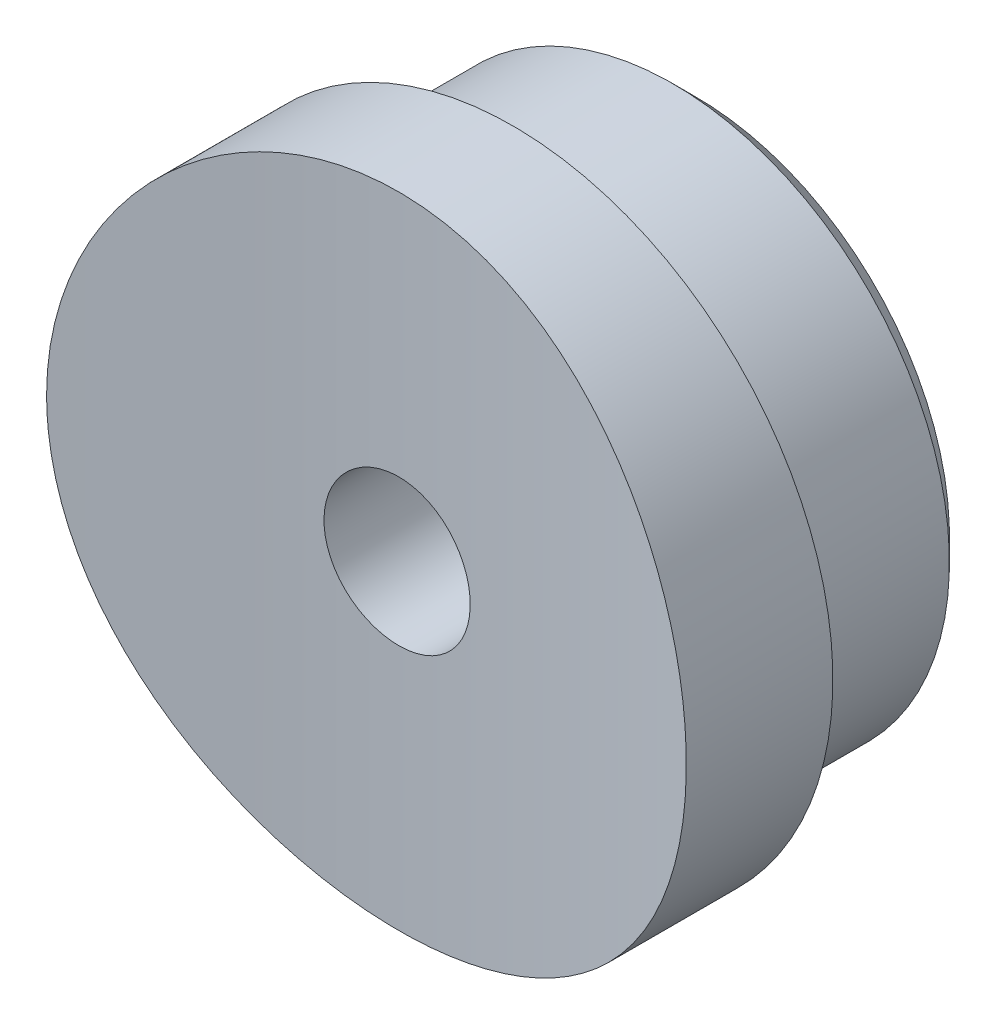
ISO-10303-21;
HEADER;
FILE_DESCRIPTION(('STEP AP214'),'2;1');
FILE_NAME('part.step','',(''),(''),'','','');
FILE_SCHEMA(('AUTOMOTIVE_DESIGN { 1 0 10303 214 1 1 1 1 }'));
ENDSEC;
DATA;
#1=APPLICATION_CONTEXT('core data for automotive mechanical design processes');
#2=APPLICATION_PROTOCOL_DEFINITION('international standard','automotive_design',2000,#1);
#3=PRODUCT_CONTEXT('',#1,'mechanical');
#4=PRODUCT('Part','Part','',(#3));
#5=PRODUCT_RELATED_PRODUCT_CATEGORY('part','',(#4));
#6=PRODUCT_DEFINITION_FORMATION('','',#4);
#7=PRODUCT_DEFINITION_CONTEXT('part definition',#1,'design');
#8=PRODUCT_DEFINITION('design','',#6,#7);
#9=PRODUCT_DEFINITION_SHAPE('','',#8);
#10=(LENGTH_UNIT() NAMED_UNIT(*) SI_UNIT(.MILLI.,.METRE.));
#11=(NAMED_UNIT(*) PLANE_ANGLE_UNIT() SI_UNIT($,.RADIAN.));
#12=(NAMED_UNIT(*) SI_UNIT($,.STERADIAN.) SOLID_ANGLE_UNIT());
#13=UNCERTAINTY_MEASURE_WITH_UNIT(LENGTH_MEASURE(1.E-05),#10,'distance_accuracy_value','');
#14=(GEOMETRIC_REPRESENTATION_CONTEXT(3) GLOBAL_UNCERTAINTY_ASSIGNED_CONTEXT((#13)) GLOBAL_UNIT_ASSIGNED_CONTEXT((#10,
#11,#12)) REPRESENTATION_CONTEXT('',''));
#15=CARTESIAN_POINT('',(0.,0.,0.));
#16=DIRECTION('',(0.,0.,1.));
#17=DIRECTION('',(1.,0.,0.));
#18=AXIS2_PLACEMENT_3D('',#15,#16,#17);
#19=CARTESIAN_POINT('',(7.,14.,-2.5));
#20=DIRECTION('',(0.,0.,1.));
#21=DIRECTION('',(1.,0.,0.));
#22=AXIS2_PLACEMENT_3D('',#19,#20,#21);
#23=PLANE('',#22);
#24=CARTESIAN_POINT('',(0.,7.,-2.5));
#25=DIRECTION('',(0.,0.,-1.));
#26=DIRECTION('',(-1.,0.,0.));
#27=AXIS2_PLACEMENT_3D('',#24,#25,#26);
#28=CIRCLE('',#27,6.05);
#29=CARTESIAN_POINT('',(-6.05,7.,-2.5));
#30=VERTEX_POINT('',#29);
#31=EDGE_CURVE('E66',#30,#30,#28,.T.);
#32=ORIENTED_EDGE('',*,*,#31,.F.);
#33=EDGE_LOOP('',(#32));
#34=FACE_BOUND('',#33,.T.);
#35=CARTESIAN_POINT('',(0.,7.,-2.5));
#36=DIRECTION('',(0.,0.,-1.));
#37=DIRECTION('',(-1.,0.,0.));
#38=AXIS2_PLACEMENT_3D('',#35,#36,#37);
#39=CIRCLE('',#38,7.);
#40=CARTESIAN_POINT('',(-7.,7.,-2.5));
#41=VERTEX_POINT('',#40);
#42=EDGE_CURVE('E83',#41,#41,#39,.T.);
#43=ORIENTED_EDGE('',*,*,#42,.T.);
#44=EDGE_LOOP('',(#43));
#45=FACE_BOUND('',#44,.T.);
#46=ADVANCED_FACE('F50',(#34,#45),#23,.F.);
#47=CARTESIAN_POINT('',(0.,14.,35.));
#48=DIRECTION('',(0.,-1.,0.));
#49=DIRECTION('',(0.,0.,-1.));
#50=AXIS2_PLACEMENT_3D('',#47,#48,#49);
#51=CYLINDRICAL_SURFACE('',#50,35.);
#52=CARTESIAN_POINT('',(-1.6,7.,0.0365905552676404));
#53=CARTESIAN_POINT('',(-1.59999603251046,7.08982230935875,0.0365900631684028));
#54=CARTESIAN_POINT('',(-1.59241080534589,7.17970855311235,0.0362407001403127));
#55=CARTESIAN_POINT('',(-1.56225902518611,7.35700206916885,0.0348807280095771));
#56=CARTESIAN_POINT('',(-1.53967475798923,7.44440628271039,0.0338693370575155));
#57=CARTESIAN_POINT('',(-1.48017226417196,7.61414176456258,0.0313001135826514));
#58=CARTESIAN_POINT('',(-1.44326126905072,7.69647556793792,0.0297425567784821));
#59=CARTESIAN_POINT('',(-1.35616400595942,7.85375606940907,0.0262568560726992));
#60=CARTESIAN_POINT('',(-1.30598089898924,7.92870452063732,0.0243288004421167));
#61=CARTESIAN_POINT('',(-1.193714969461,8.06917449702193,0.020317433367977));
#62=CARTESIAN_POINT('',(-1.13162316006113,8.13468883698272,0.0182340054038236));
#63=CARTESIAN_POINT('',(-0.997320037115527,8.25436973559786,0.0141477639445384));
#64=CARTESIAN_POINT('',(-0.925108313306346,8.30853583396988,0.0121449537219061));
#65=CARTESIAN_POINT('',(-0.772579135432526,8.40400123079447,0.00844480783740266));
#66=CARTESIAN_POINT('',(-0.692258291409238,8.44529511838057,0.00674760076285946));
#67=CARTESIAN_POINT('',(-0.525814796203896,8.51380913007604,0.00385107335846876));
#68=CARTESIAN_POINT('',(-0.439692183634218,8.54102934783912,0.0026517497154495));
#69=CARTESIAN_POINT('',(-0.264154268886323,8.5806048676508,0.000886909864028627));
#70=CARTESIAN_POINT('',(-0.174741333410031,8.59297064701238,0.000320946945240545));
#71=CARTESIAN_POINT('',(0.00489287983636078,8.60251859609575,-0.000114885948178931));
#72=CARTESIAN_POINT('',(0.0951141520444085,8.59970087021312,1.52392911711064E-05));
#73=CARTESIAN_POINT('',(0.273733044474519,8.57897051104271,0.00095654069370121));
#74=CARTESIAN_POINT('',(0.362131977073956,8.56106915927871,0.00176720785624695));
#75=CARTESIAN_POINT('',(0.534668745707059,8.51069718333591,0.00397768170900068));
#76=CARTESIAN_POINT('',(0.618806566037045,8.47822650546841,0.00537749057022369));
#77=CARTESIAN_POINT('',(0.78046908853887,8.39962471439854,0.00860942360492793));
#78=CARTESIAN_POINT('',(0.857991284318649,8.35348845319632,0.01044171064553));
#79=CARTESIAN_POINT('',(1.00419457839483,8.24886890364598,0.0143322174306972));
#80=CARTESIAN_POINT('',(1.07287562507272,8.19038554321532,0.0163904384942347));
#81=CARTESIAN_POINT('',(1.19951280224942,8.0626681272547,0.0205032063948754));
#82=CARTESIAN_POINT('',(1.25745906278686,7.99342428462489,0.0225577481474423));
#83=CARTESIAN_POINT('',(1.36090576706526,7.84618589630842,0.0264296385537858));
#84=CARTESIAN_POINT('',(1.40640620788382,7.76819134856701,0.028246987151867));
#85=CARTESIAN_POINT('',(1.48366876991119,7.60565967054864,0.031439411727319));
#86=CARTESIAN_POINT('',(1.51543053302928,7.52112236980628,0.0328144761765685));
#87=CARTESIAN_POINT('',(1.564307610156,7.34790753152688,0.0349668189863988));
#88=CARTESIAN_POINT('',(1.58142301626911,7.25923002002949,0.0357441011061653));
#89=CARTESIAN_POINT('',(1.60050935389465,7.08033793822746,0.0366125352846522));
#90=CARTESIAN_POINT('',(1.60249397826954,6.99012483171716,0.0367043077056994));
#91=CARTESIAN_POINT('',(1.59129813665862,6.81064684042022,0.036192992844107));
#92=CARTESIAN_POINT('',(1.57811771245672,6.72138195302165,0.0355899074759934));
#93=CARTESIAN_POINT('',(1.53697726974449,6.54637269653808,0.0337574196386319));
#94=CARTESIAN_POINT('',(1.50902350724693,6.46062685380662,0.0325282822893566));
#95=CARTESIAN_POINT('',(1.43913622493794,6.29504433373077,0.0295824572828065));
#96=CARTESIAN_POINT('',(1.39720263769836,6.21520768489014,0.0278657672739508));
#97=CARTESIAN_POINT('',(1.30051086272365,6.06364680300981,0.0241368213771836));
#98=CARTESIAN_POINT('',(1.24574347063267,5.99192844738645,0.0221243537467004));
#99=CARTESIAN_POINT('',(1.12495219467397,5.85869907151653,0.0180314349565567));
#100=CARTESIAN_POINT('',(1.05892824995501,5.79718810645315,0.0159509834294346));
#101=CARTESIAN_POINT('',(0.917439273522795,5.68607364405741,0.0119547832210798));
#102=CARTESIAN_POINT('',(0.841967295308717,5.63647898712045,0.01003915749189));
#103=CARTESIAN_POINT('',(0.683759801826339,5.55066537757432,0.00659026900767956));
#104=CARTESIAN_POINT('',(0.60102431428758,5.51444637390433,0.00505700479302213));
#105=CARTESIAN_POINT('',(0.430671358626741,5.45642767299037,0.00254623638509237));
#106=CARTESIAN_POINT('',(0.343055826121985,5.43462230227563,0.00156851354183241));
#107=CARTESIAN_POINT('',(0.165402696787812,5.40603125732229,0.000278154167754272));
#108=CARTESIAN_POINT('',(0.075365110664006,5.39924551670715,-3.44853022800989E-05));
#109=CARTESIAN_POINT('',(-0.104488444172776,5.40088701134011,4.05436056442141E-05));
#110=CARTESIAN_POINT('',(-0.194304540149235,5.4093003682873,0.000427573115852465));
#111=CARTESIAN_POINT('',(-0.371247753070772,5.44107257384797,0.00185710271096491));
#112=CARTESIAN_POINT('',(-0.458374864871483,5.46443145105226,0.00289960404978786));
#113=CARTESIAN_POINT('',(-0.627470134876942,5.52542891156803,0.00552275523222708));
#114=CARTESIAN_POINT('',(-0.709438239079783,5.56306764432492,0.00710341070786163));
#115=CARTESIAN_POINT('',(-0.865892148926715,5.65155371559135,0.0106250187551743));
#116=CARTESIAN_POINT('',(-0.940378194598089,5.70240063018962,0.012565959763063));
#117=CARTESIAN_POINT('',(-1.07982231622105,5.81590843378396,0.0165916134487838));
#118=CARTESIAN_POINT('',(-1.14477267857191,5.87857879438379,0.0186764405367522));
#119=CARTESIAN_POINT('',(-1.263250157843,6.01395210283898,0.0227542057000625));
#120=CARTESIAN_POINT('',(-1.31677445574384,6.08665751925803,0.0247471210042256));
#121=CARTESIAN_POINT('',(-1.41090141417986,6.24008686335503,0.0284174654941289));
#122=CARTESIAN_POINT('',(-1.45149267396095,6.32081778390503,0.0300946157963982));
#123=CARTESIAN_POINT('',(-1.51849657197888,6.48789555406184,0.0329397371298798));
#124=CARTESIAN_POINT('',(-1.54492599882545,6.57423561730652,0.0341083107598585));
#125=CARTESIAN_POINT('',(-1.57590509189012,6.71759537607352,0.0354943310481097));
#126=CARTESIAN_POINT('',(-1.58492918948196,6.77368598022787,0.0359036091059517));
#127=CARTESIAN_POINT('',(-1.59697789492852,6.8865092137755,0.0364518765972318));
#128=CARTESIAN_POINT('',(-1.6000025070319,6.94324184271409,0.0365908662220807));
#129=CARTESIAN_POINT('',(-1.6,7.,0.0365905552676404));
#130=B_SPLINE_CURVE_WITH_KNOTS('',3,(#52,#53,#54,#55,#56,#57,#58,#59,#60,#61,#62,#63,#64,#65,
#66,#67,#68,#69,#70,#71,#72,#73,#74,#75,#76,#77,#78,#79,#80,#81,#82,#83,#84,#85,#86,#87,#88,#89,
#90,#91,#92,#93,#94,#95,#96,#97,#98,#99,#100,#101,#102,#103,#104,#105,#106,#107,#108,#109,#110,
#111,#112,#113,#114,#115,#116,#117,#118,#119,#120,#121,#122,#123,#124,#125,#126,#127,#128,#129),
.UNSPECIFIED.,.T.,.F.,(4,2,2,2,2,2,2,2,2,2,2,2,2,2,2,2,2,2,2,2,2,2,2,2,2,2,2,2,2,2,2,2,2,2,2,2,
2,2,4),(0.,0.269259742710959,0.53883805404294,0.808280470738463,1.07765877241932,
1.34724116467661,1.61683448902378,1.88654098526754,2.15624568671717,2.42576004486211,
2.69527254993852,2.96458365678232,3.23389575605897,3.50330943795457,3.77272469273454,
4.04238644165521,4.31204825389508,4.58171709429145,4.85138423884728,5.12080731445916,
5.39022964773748,5.65953798101369,5.92884761324925,6.19835098768673,6.46785581906538,
6.73755997588626,7.0072631031157,7.27686000692234,7.54645571929155,7.81580538813915,
8.0851555722547,8.35450857532432,8.62385293468569,8.89341398549846,9.1630414652934,
9.43290597415438,9.70244985148553,9.87259352469369,10.0427370774108),.UNSPECIFIED.);
#131=CARTESIAN_POINT('',(-1.6,7.,0.0365905552676404));
#132=VERTEX_POINT('',#131);
#133=EDGE_CURVE('E103',#132,#132,#130,.T.);
#134=ORIENTED_EDGE('',*,*,#133,.T.);
#135=EDGE_LOOP('',(#134));
#136=FACE_BOUND('',#135,.T.);
#137=CARTESIAN_POINT('',(-7.,7.,0.707143601035506));
#138=CARTESIAN_POINT('',(-7.00000256201427,7.19450607109619,0.707144987961641));
#139=CARTESIAN_POINT('',(-6.99188990560942,7.38897681245728,0.705485368825013));
#140=CARTESIAN_POINT('',(-6.95950756673834,7.77657394297217,0.698898819525174));
#141=CARTESIAN_POINT('',(-6.93523432420624,7.96970002643265,0.693971169438171));
#142=CARTESIAN_POINT('',(-6.87069594687071,8.35329144556598,0.680987560328509));
#143=CARTESIAN_POINT('',(-6.83041930523723,8.54375476441676,0.672929350450831));
#144=CARTESIAN_POINT('',(-6.73417546270055,8.92060214354526,0.65391891769761));
#145=CARTESIAN_POINT('',(-6.67820244510575,9.10698466392279,0.642965622060994));
#146=CARTESIAN_POINT('',(-6.55109641298841,9.47402524648489,0.618503321877701));
#147=CARTESIAN_POINT('',(-6.47998562073503,9.65469125872703,0.60499806684012));
#148=CARTESIAN_POINT('',(-6.32305707846325,10.009414817973,0.575803320823897));
#149=CARTESIAN_POINT('',(-6.23723382639971,10.1834698628063,0.560113013110553));
#150=CARTESIAN_POINT('',(-6.05157221341618,10.5236342907896,0.52700541779589));
#151=CARTESIAN_POINT('',(-5.95174180163214,10.6897481094342,0.509589111342881));
#152=CARTESIAN_POINT('',(-5.7386804858834,11.0131102397861,0.473499723790336));
#153=CARTESIAN_POINT('',(-5.62544348009354,11.1703544661789,0.454826072108058));
#154=CARTESIAN_POINT('',(-5.38486719157037,11.4767875395606,0.416503601340912));
#155=CARTESIAN_POINT('',(-5.25736795334596,11.625849663529,0.396845448822996));
#156=CARTESIAN_POINT('',(-4.99038938145465,11.912675883633,0.357335402177284));
#157=CARTESIAN_POINT('',(-4.85091533078846,12.0504449101062,0.337483596876059));
#158=CARTESIAN_POINT('',(-4.56077826934255,12.3139182442317,0.298116141991379));
#159=CARTESIAN_POINT('',(-4.41010753899529,12.4396140885316,0.278600735976089));
#160=CARTESIAN_POINT('',(-4.09873491271125,12.677921615805,0.240469505275797));
#161=CARTESIAN_POINT('',(-3.93803680007915,12.790538188213,0.22185334595468));
#162=CARTESIAN_POINT('',(-3.60606256450975,13.0029586741639,0.185858524126111));
#163=CARTESIAN_POINT('',(-3.43470013092133,13.1026300620541,0.168493366252587));
#164=CARTESIAN_POINT('',(-3.08406037570447,13.2871141427914,0.135697853993586));
#165=CARTESIAN_POINT('',(-2.90478603831984,13.371932379044,0.120266778395202));
#166=CARTESIAN_POINT('',(-2.53966848938492,13.5260486619547,0.0917835801214951));
#167=CARTESIAN_POINT('',(-2.3538307327454,13.5953592613194,0.0787295349563805));
#168=CARTESIAN_POINT('',(-1.97685097675786,13.7179872723742,0.0553617833275128));
#169=CARTESIAN_POINT('',(-1.78571028597549,13.771308591938,0.0450474073430496));
#170=CARTESIAN_POINT('',(-1.33200797201004,13.8773029583291,0.0243847114536106));
#171=CARTESIAN_POINT('',(-1.06779111300855,13.9232615572635,0.0152796373814998));
#172=CARTESIAN_POINT('',(-0.535693809849318,13.9846080172751,0.00308822885457686));
#173=CARTESIAN_POINT('',(-0.26781343849408,13.9999964849654,1.77497032730406E-06));
#174=CARTESIAN_POINT('',(0.194549799260604,14.0000025534539,-1.28940550412594E-06));
#175=CARTESIAN_POINT('',(0.389064277257506,13.9918862851451,0.00162524279221302));
#176=CARTESIAN_POINT('',(0.776750075695149,13.9594891627945,0.00808345274654491));
#177=CARTESIAN_POINT('',(0.969921091177818,13.9352047523835,0.0129158356661511));
#178=CARTESIAN_POINT('',(1.35360341236926,13.8706358200097,0.0256574067320947));
#179=CARTESIAN_POINT('',(1.54411271375299,13.8303398492918,0.0335687963790442));
#180=CARTESIAN_POINT('',(1.92105306880348,13.7340483088031,0.052250767142241));
#181=CARTESIAN_POINT('',(2.10748258531489,13.6780469278129,0.0630224065119242));
#182=CARTESIAN_POINT('',(2.4746231291438,13.5508724269082,0.0871078206977945));
#183=CARTESIAN_POINT('',(2.65534190212087,13.4797209676882,0.100417963306554));
#184=CARTESIAN_POINT('',(3.01016656072189,13.3227012196575,0.129230067784244));
#185=CARTESIAN_POINT('',(3.1842699434249,13.2368274270942,0.144732848961827));
#186=CARTESIAN_POINT('',(3.52452260684099,13.0510569526137,0.177493775800212));
#187=CARTESIAN_POINT('',(3.69067635426106,12.9511682724088,0.19475091828159));
#188=CARTESIAN_POINT('',(4.01410762749403,12.7379849819156,0.23056759624482));
#189=CARTESIAN_POINT('',(4.17138106468813,12.6246842696888,0.249127722957636));
#190=CARTESIAN_POINT('',(4.47777577630471,12.3840436943884,0.287269653307298));
#191=CARTESIAN_POINT('',(4.62677576843434,12.2565509102057,0.306861083373583));
#192=CARTESIAN_POINT('',(4.91347711984721,11.9895983583937,0.346303553881793));
#193=CARTESIAN_POINT('',(5.0511834074547,11.8501438655309,0.366154476654931));
#194=CARTESIAN_POINT('',(5.31453369642744,11.5600585202051,0.405586055525949));
#195=CARTESIAN_POINT('',(5.44016915141814,11.4094198809966,0.425166511851576));
#196=CARTESIAN_POINT('',(5.67836041932564,11.0981238414653,0.463486372172019));
#197=CARTESIAN_POINT('',(5.79092111054966,10.9374702124244,0.482226088242141));
#198=CARTESIAN_POINT('',(6.00327723395975,10.6055324494877,0.518521113958185));
#199=CARTESIAN_POINT('',(6.10293488787147,10.4341586354902,0.536062822899178));
#200=CARTESIAN_POINT('',(6.28739033785769,10.0834974466381,0.569236068794655));
#201=CARTESIAN_POINT('',(6.37219367874141,9.90421305605836,0.584868317848903));
#202=CARTESIAN_POINT('',(6.52627951718141,9.53907540324621,0.613755320884649));
#203=CARTESIAN_POINT('',(6.59557465506782,9.35322763477121,0.62701200935381));
#204=CARTESIAN_POINT('',(6.71817151371187,8.97622532704229,0.650763325244406));
#205=CARTESIAN_POINT('',(6.7714771577052,8.78507210214948,0.661258630130375));
#206=CARTESIAN_POINT('',(6.87740367604529,8.33146423724987,0.682289775244156));
#207=CARTESIAN_POINT('',(6.92332428627756,8.06735664688799,0.691567460749613));
#208=CARTESIAN_POINT('',(6.98462035938484,7.53547701055397,0.703993353835754));
#209=CARTESIAN_POINT('',(6.99999647381629,7.26770504287077,0.70714169216388));
#210=CARTESIAN_POINT('',(7.00000256201427,6.80549392890381,0.707144987961641));
#211=CARTESIAN_POINT('',(6.99188990560942,6.61102318754272,0.705485368825013));
#212=CARTESIAN_POINT('',(6.95950756673834,6.22342605702783,0.698898819525174));
#213=CARTESIAN_POINT('',(6.93523432420624,6.03029997356735,0.693971169438171));
#214=CARTESIAN_POINT('',(6.87069594687071,5.64670855443402,0.680987560328509));
#215=CARTESIAN_POINT('',(6.83041930523723,5.45624523558324,0.672929350450831));
#216=CARTESIAN_POINT('',(6.73417546270055,5.07939785645474,0.65391891769761));
#217=CARTESIAN_POINT('',(6.67820244510575,4.89301533607721,0.642965622060995));
#218=CARTESIAN_POINT('',(6.55109641298841,4.52597475351511,0.618503321877701));
#219=CARTESIAN_POINT('',(6.47998562073503,4.34530874127297,0.604998066840121));
#220=CARTESIAN_POINT('',(6.32305707846325,3.99058518202703,0.575803320823897));
#221=CARTESIAN_POINT('',(6.23723382639971,3.8165301371937,0.560113013110554));
#222=CARTESIAN_POINT('',(6.05157221341618,3.47636570921041,0.527005417795891));
#223=CARTESIAN_POINT('',(5.95174180163214,3.31025189056581,0.509589111342882));
#224=CARTESIAN_POINT('',(5.7386804858834,2.98688976021391,0.473499723790338));
#225=CARTESIAN_POINT('',(5.62544348009354,2.82964553382113,0.454826072108059));
#226=CARTESIAN_POINT('',(5.38486719157037,2.52321246043939,0.416503601340912));
#227=CARTESIAN_POINT('',(5.25736795334596,2.37415033647101,0.396845448822993));
#228=CARTESIAN_POINT('',(4.99038938145465,2.087324116367,0.357335402177279));
#229=CARTESIAN_POINT('',(4.85091533078846,1.9495550898938,0.337483596876052));
#230=CARTESIAN_POINT('',(4.56077826934255,1.6860817557683,0.298116141991372));
#231=CARTESIAN_POINT('',(4.41010753899529,1.56038591146837,0.278600735976084));
#232=CARTESIAN_POINT('',(4.09873491271125,1.32207838419499,0.240469505275794));
#233=CARTESIAN_POINT('',(3.93803680007915,1.20946181178702,0.221853345954679));
#234=CARTESIAN_POINT('',(3.60606256450975,0.997041325836138,0.185858524126113));
#235=CARTESIAN_POINT('',(3.43470013092132,0.897369937945933,0.168493366252589));
#236=CARTESIAN_POINT('',(3.08406037570447,0.71288585720863,0.135697853993587));
#237=CARTESIAN_POINT('',(2.90478603831983,0.62806762095605,0.120266778395203));
#238=CARTESIAN_POINT('',(2.53966848938491,0.473951338045279,0.091783580121495));
#239=CARTESIAN_POINT('',(2.35383073274539,0.404640738680595,0.0787295349563804));
#240=CARTESIAN_POINT('',(1.97685097675786,0.282012727625821,0.0553617833275129));
#241=CARTESIAN_POINT('',(1.78571028597549,0.22869140806198,0.0450474073430499));
#242=CARTESIAN_POINT('',(1.33200797201004,0.122697041670865,0.0243847114536111));
#243=CARTESIAN_POINT('',(1.06779111300854,0.076738442736474,0.0152796373815002));
#244=CARTESIAN_POINT('',(0.535693809849318,0.0153919827249359,0.00308822885457731));
#245=CARTESIAN_POINT('',(0.267813438494081,3.51503462040437E-06,1.77497032778755E-06));
#246=CARTESIAN_POINT('',(-0.194549799260602,-2.55345394099559E-06,-1.28940550366994E-06));
#247=CARTESIAN_POINT('',(-0.389064277257502,0.00811371485487339,0.00162524279221342));
#248=CARTESIAN_POINT('',(-0.776750075695143,0.040510837205468,0.00808345274654514));
#249=CARTESIAN_POINT('',(-0.969921091177813,0.0647952476164989,0.0129158356661512));
#250=CARTESIAN_POINT('',(-1.35360341236926,0.129364179990286,0.0256574067320948));
#251=CARTESIAN_POINT('',(-1.54411271375299,0.169660150708168,0.0335687963790442));
#252=CARTESIAN_POINT('',(-1.92105306880347,0.26595169119687,0.052250767142241));
#253=CARTESIAN_POINT('',(-2.10748258531489,0.321953072187099,0.0630224065119241));
#254=CARTESIAN_POINT('',(-2.4746231291438,0.449127573091819,0.0871078206977944));
#255=CARTESIAN_POINT('',(-2.65534190212087,0.520279032311778,0.100417963306554));
#256=CARTESIAN_POINT('',(-3.01016656072189,0.677298780342475,0.129230067784244));
#257=CARTESIAN_POINT('',(-3.1842699434249,0.763172572905805,0.144732848961827));
#258=CARTESIAN_POINT('',(-3.52452260684099,0.948943047386334,0.177493775800212));
#259=CARTESIAN_POINT('',(-3.69067635426106,1.04883172759123,0.19475091828159));
#260=CARTESIAN_POINT('',(-4.01410762749403,1.26201501808442,0.230567596244819));
#261=CARTESIAN_POINT('',(-4.17138106468813,1.37531573031118,0.249127722957636));
#262=CARTESIAN_POINT('',(-4.47777577630471,1.61595630561161,0.287269653307298));
#263=CARTESIAN_POINT('',(-4.62677576843434,1.74344908979428,0.306861083373583));
#264=CARTESIAN_POINT('',(-4.91347711984721,2.01040164160628,0.346303553881793));
#265=CARTESIAN_POINT('',(-5.0511834074547,2.14985613446912,0.366154476654931));
#266=CARTESIAN_POINT('',(-5.31453369642744,2.43994147979488,0.405586055525949));
#267=CARTESIAN_POINT('',(-5.44016915141814,2.59058011900339,0.425166511851575));
#268=CARTESIAN_POINT('',(-5.67836041932564,2.90187615853472,0.463486372172019));
#269=CARTESIAN_POINT('',(-5.79092111054966,3.06252978757562,0.482226088242141));
#270=CARTESIAN_POINT('',(-6.00327723395975,3.39446755051233,0.518521113958185));
#271=CARTESIAN_POINT('',(-6.10293488787147,3.56584136450982,0.536062822899178));
#272=CARTESIAN_POINT('',(-6.28739033785769,3.91650255336194,0.569236068794655));
#273=CARTESIAN_POINT('',(-6.37219367874141,4.09578694394164,0.584868317848904));
#274=CARTESIAN_POINT('',(-6.52627951718141,4.46092459675378,0.613755320884649));
#275=CARTESIAN_POINT('',(-6.59557465506782,4.64677236522879,0.62701200935381));
#276=CARTESIAN_POINT('',(-6.71817151371187,5.0237746729577,0.650763325244406));
#277=CARTESIAN_POINT('',(-6.7714771577052,5.21492789785052,0.661258630130375));
#278=CARTESIAN_POINT('',(-6.87740367604529,5.66853576275013,0.682289775244156));
#279=CARTESIAN_POINT('',(-6.92332428627756,5.93264335311201,0.691567460749613));
#280=CARTESIAN_POINT('',(-6.98462035938484,6.46452298944603,0.703993353835755));
#281=CARTESIAN_POINT('',(-6.99999647381629,6.73229495712923,0.70714169216388));
#282=CARTESIAN_POINT('',(-7.,7.,0.707143601035506));
#283=B_SPLINE_CURVE_WITH_KNOTS('',3,(#137,#138,#139,#140,#141,#142,#143,#144,#145,#146,#147,
#148,#149,#150,#151,#152,#153,#154,#155,#156,#157,#158,#159,#160,#161,#162,#163,#164,#165,#166,
#167,#168,#169,#170,#171,#172,#173,#174,#175,#176,#177,#178,#179,#180,#181,#182,#183,#184,#185,
#186,#187,#188,#189,#190,#191,#192,#193,#194,#195,#196,#197,#198,#199,#200,#201,#202,#203,#204,
#205,#206,#207,#208,#209,#210,#211,#212,#213,#214,#215,#216,#217,#218,#219,#220,#221,#222,#223,
#224,#225,#226,#227,#228,#229,#230,#231,#232,#233,#234,#235,#236,#237,#238,#239,#240,#241,#242,
#243,#244,#245,#246,#247,#248,#249,#250,#251,#252,#253,#254,#255,#256,#257,#258,#259,#260,#261,
#262,#263,#264,#265,#266,#267,#268,#269,#270,#271,#272,#273,#274,#275,#276,#277,#278,#279,#280,
#281,#282),.UNSPECIFIED.,.T.,.F.,(4,2,2,2,2,2,2,2,2,2,2,2,2,2,2,2,2,2,2,2,2,2,2,2,2,2,2,2,2,2,2,
2,2,2,2,2,2,2,2,2,2,2,2,2,2,2,2,2,2,2,2,2,2,2,2,2,2,2,2,2,2,2,2,2,2,2,2,2,2,2,2,2,4),(0.,
0.583281436579045,1.166691408577,1.75052162773398,2.33456848659252,2.91776380481801,
3.50117769934287,4.08426183262088,4.66761237619073,5.25832580906995,5.84877995944412,
6.43964504521818,7.0302885315678,7.62656847294854,8.22262539775947,8.81819808267083,
9.41362508726277,10.2167556244034,11.0198702246014,11.6032830104958,12.1868241671742,
12.770783326635,13.3549588448053,13.9383046849762,14.5218690788244,15.1051016358933,
15.6886005677315,16.2791410289185,16.8694224046598,17.4601186774877,18.0505938436591,
18.6469292875733,19.2430416551604,19.8386663631377,20.4341448068753,21.2369511771442,
22.0397404222568,22.6230218588358,23.2064318308338,23.7902620499908,24.3743089088493,
24.9575042270748,25.5409181215997,26.1240022548777,26.7073527984475,27.2980662313267,
27.8885203817009,28.479385467475,29.0700289538246,29.6663088952053,30.2623658200163,
30.8579385049276,31.4533655095195,32.2564960466601,33.0596106468581,33.6430234327525,
34.2265645894309,34.8105237488918,35.3946992670621,35.978045107233,36.5616095010812,
37.1448420581501,37.7283409899883,38.3188814511753,38.9091628269165,39.4998590997445,
40.0903342659159,40.68666970983,41.2827820774172,41.8784067853945,42.473885229132,
43.276691599401,44.0794808445136),.UNSPECIFIED.);
#284=CARTESIAN_POINT('',(-7.,7.,0.707143601035506));
#285=VERTEX_POINT('',#284);
#286=EDGE_CURVE('E73',#285,#285,#283,.T.);
#287=ORIENTED_EDGE('',*,*,#286,.F.);
#288=EDGE_LOOP('',(#287));
#289=FACE_BOUND('',#288,.T.);
#290=ADVANCED_FACE('F84',(#136,#289),#51,.F.);
#291=CARTESIAN_POINT('',(0.,7.,11.5));
#292=DIRECTION('',(0.,0.,-1.));
#293=DIRECTION('',(-1.,0.,0.));
#294=AXIS2_PLACEMENT_3D('',#291,#292,#293);
#295=CYLINDRICAL_SURFACE('',#294,7.);
#296=ORIENTED_EDGE('',*,*,#42,.F.);
#297=EDGE_LOOP('',(#296));
#298=FACE_BOUND('',#297,.T.);
#299=ORIENTED_EDGE('',*,*,#286,.T.);
#300=EDGE_LOOP('',(#299));
#301=FACE_BOUND('',#300,.T.);
#302=ADVANCED_FACE('F86',(#298,#301),#295,.T.);
#303=CARTESIAN_POINT('',(0.,7.,-6.5));
#304=DIRECTION('',(0.,0.,1.));
#305=DIRECTION('',(1.,0.,0.));
#306=AXIS2_PLACEMENT_3D('',#303,#304,#305);
#307=CYLINDRICAL_SURFACE('',#306,6.05);
#308=CARTESIAN_POINT('',(0.,7.,-6.));
#309=DIRECTION('',(0.,0.,-1.));
#310=DIRECTION('',(-1.,0.,0.));
#311=AXIS2_PLACEMENT_3D('',#308,#309,#310);
#312=CIRCLE('',#311,6.05);
#313=CARTESIAN_POINT('',(-6.05,7.,-6.));
#314=VERTEX_POINT('',#313);
#315=EDGE_CURVE('E12',#314,#314,#312,.F.);
#316=ORIENTED_EDGE('',*,*,#315,.T.);
#317=EDGE_LOOP('',(#316));
#318=FACE_BOUND('',#317,.T.);
#319=ORIENTED_EDGE('',*,*,#31,.T.);
#320=EDGE_LOOP('',(#319));
#321=FACE_BOUND('',#320,.T.);
#322=ADVANCED_FACE('F90',(#318,#321),#307,.T.);
#323=CARTESIAN_POINT('',(0.,7.,-6.5));
#324=DIRECTION('',(0.,0.,-1.));
#325=DIRECTION('',(-1.,0.,0.));
#326=AXIS2_PLACEMENT_3D('',#323,#324,#325);
#327=PLANE('',#326);
#328=CARTESIAN_POINT('',(0.,7.,-6.5));
#329=DIRECTION('',(0.,0.,-1.));
#330=DIRECTION('',(-1.,0.,0.));
#331=AXIS2_PLACEMENT_3D('',#328,#329,#330);
#332=CIRCLE('',#331,1.6);
#333=CARTESIAN_POINT('',(-1.6,7.,-6.5));
#334=VERTEX_POINT('',#333);
#335=EDGE_CURVE('E108',#334,#334,#332,.T.);
#336=ORIENTED_EDGE('',*,*,#335,.F.);
#337=EDGE_LOOP('',(#336));
#338=FACE_BOUND('',#337,.T.);
#339=CARTESIAN_POINT('',(0.,7.,-6.5));
#340=DIRECTION('',(0.,0.,-1.));
#341=DIRECTION('',(-1.,0.,0.));
#342=AXIS2_PLACEMENT_3D('',#339,#340,#341);
#343=CIRCLE('',#342,5.55);
#344=CARTESIAN_POINT('',(-5.55,7.,-6.5));
#345=VERTEX_POINT('',#344);
#346=EDGE_CURVE('E58',#345,#345,#343,.T.);
#347=ORIENTED_EDGE('',*,*,#346,.T.);
#348=EDGE_LOOP('',(#347));
#349=FACE_BOUND('',#348,.T.);
#350=ADVANCED_FACE('F94',(#338,#349),#327,.T.);
#351=CARTESIAN_POINT('',(0.,7.,-6.5));
#352=DIRECTION('',(0.,0.,1.));
#353=DIRECTION('',(1.,0.,0.));
#354=AXIS2_PLACEMENT_3D('',#351,#352,#353);
#355=CONICAL_SURFACE('',#354,5.55,0.785398163397447);
#356=ORIENTED_EDGE('',*,*,#315,.F.);
#357=EDGE_LOOP('',(#356));
#358=FACE_BOUND('',#357,.T.);
#359=ORIENTED_EDGE('',*,*,#346,.F.);
#360=EDGE_LOOP('',(#359));
#361=FACE_BOUND('',#360,.T.);
#362=ADVANCED_FACE('F52',(#358,#361),#355,.T.);
#363=CARTESIAN_POINT('',(0.,7.,1.11236402811845));
#364=DIRECTION('',(0.,0.,-1.));
#365=DIRECTION('',(-1.,0.,0.));
#366=AXIS2_PLACEMENT_3D('',#363,#364,#365);
#367=CYLINDRICAL_SURFACE('',#366,1.6);
#368=ORIENTED_EDGE('',*,*,#335,.T.);
#369=EDGE_LOOP('',(#368));
#370=FACE_BOUND('',#369,.T.);
#371=ORIENTED_EDGE('',*,*,#133,.F.);
#372=EDGE_LOOP('',(#371));
#373=FACE_BOUND('',#372,.T.);
#374=ADVANCED_FACE('F98',(#370,#373),#367,.F.);
#375=CLOSED_SHELL('',(#46,#290,#302,#322,#350,#362,#374));
#376=MANIFOLD_SOLID_BREP('B2',#375);
#377=ADVANCED_BREP_SHAPE_REPRESENTATION('',(#18,#376),#14);
#378=SHAPE_DEFINITION_REPRESENTATION(#9,#377);
ENDSEC;
END-ISO-10303-21;
